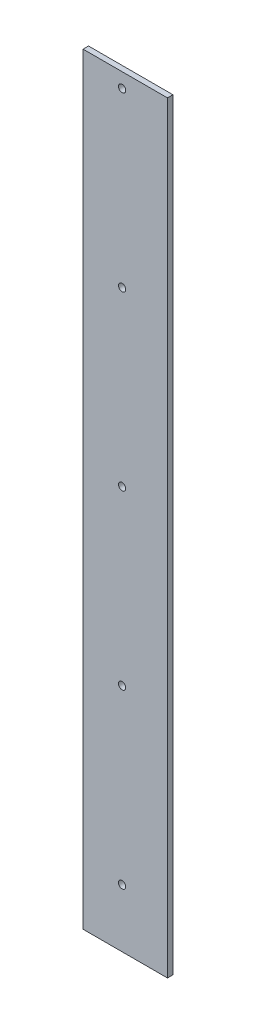
ISO-10303-21;
HEADER;
FILE_DESCRIPTION(('STEP AP214'),'2;1');
FILE_NAME('part.step','',(''),(''),'','','');
FILE_SCHEMA(('AUTOMOTIVE_DESIGN { 1 0 10303 214 1 1 1 1 }'));
ENDSEC;
DATA;
#1=APPLICATION_CONTEXT('core data for automotive mechanical design processes');
#2=APPLICATION_PROTOCOL_DEFINITION('international standard','automotive_design',2000,#1);
#3=PRODUCT_CONTEXT('',#1,'mechanical');
#4=PRODUCT('Part','Part','',(#3));
#5=PRODUCT_RELATED_PRODUCT_CATEGORY('part','',(#4));
#6=PRODUCT_DEFINITION_FORMATION('','',#4);
#7=PRODUCT_DEFINITION_CONTEXT('part definition',#1,'design');
#8=PRODUCT_DEFINITION('design','',#6,#7);
#9=PRODUCT_DEFINITION_SHAPE('','',#8);
#10=(LENGTH_UNIT() NAMED_UNIT(*) SI_UNIT(.MILLI.,.METRE.));
#11=(NAMED_UNIT(*) PLANE_ANGLE_UNIT() SI_UNIT($,.RADIAN.));
#12=(NAMED_UNIT(*) SI_UNIT($,.STERADIAN.) SOLID_ANGLE_UNIT());
#13=UNCERTAINTY_MEASURE_WITH_UNIT(LENGTH_MEASURE(1.E-05),#10,'distance_accuracy_value','');
#14=(GEOMETRIC_REPRESENTATION_CONTEXT(3) GLOBAL_UNCERTAINTY_ASSIGNED_CONTEXT((#13)) GLOBAL_UNIT_ASSIGNED_CONTEXT((#10,
#11,#12)) REPRESENTATION_CONTEXT('',''));
#15=CARTESIAN_POINT('',(0.,0.,0.));
#16=DIRECTION('',(0.,0.,1.));
#17=DIRECTION('',(1.,0.,0.));
#18=AXIS2_PLACEMENT_3D('',#15,#16,#17);
#19=CARTESIAN_POINT('',(0.,0.,3.));
#20=DIRECTION('',(0.,0.,1.));
#21=DIRECTION('',(1.,0.,0.));
#22=AXIS2_PLACEMENT_3D('',#19,#20,#21);
#23=PLANE('',#22);
#24=CARTESIAN_POINT('',(-1.19205738298243,-89.721028691555,3.));
#25=DIRECTION('',(0.,0.,1.));
#26=DIRECTION('',(1.,0.,0.));
#27=AXIS2_PLACEMENT_3D('',#24,#25,#26);
#28=CIRCLE('',#27,2.0000000000209);
#29=CARTESIAN_POINT('',(0.807942617038469,-89.721028691555,3.));
#30=VERTEX_POINT('',#29);
#31=EDGE_CURVE('E137',#30,#30,#28,.T.);
#32=ORIENTED_EDGE('',*,*,#31,.F.);
#33=EDGE_LOOP('',(#32));
#34=FACE_BOUND('',#33,.T.);
#35=CARTESIAN_POINT('',(-1.19205738298044,100.278971308445,3.));
#36=DIRECTION('',(0.,0.,1.));
#37=DIRECTION('',(1.,0.,0.));
#38=AXIS2_PLACEMENT_3D('',#35,#36,#37);
#39=CIRCLE('',#38,2.0000000000209);
#40=CARTESIAN_POINT('',(0.807942617040462,100.278971308445,3.));
#41=VERTEX_POINT('',#40);
#42=EDGE_CURVE('E125',#41,#41,#39,.T.);
#43=ORIENTED_EDGE('',*,*,#42,.F.);
#44=EDGE_LOOP('',(#43));
#45=FACE_BOUND('',#44,.T.);
#46=DIRECTION('',(0.,-1.,0.));
#47=VECTOR('',#46,1.);
#48=CARTESIAN_POINT('',(-22.6920573829741,203.278971308516,3.));
#49=LINE('',#48,#47);
#50=CARTESIAN_POINT('',(-22.6920573829741,203.278971308516,3.));
#51=VERTEX_POINT('',#50);
#52=CARTESIAN_POINT('',(-22.692057382974,-216.721028691483,3.));
#53=VERTEX_POINT('',#52);
#54=EDGE_CURVE('E95',#51,#53,#49,.T.);
#55=ORIENTED_EDGE('',*,*,#54,.T.);
#56=DIRECTION('',(1.,0.,0.));
#57=VECTOR('',#56,1.);
#58=CARTESIAN_POINT('',(-22.692057382974,-216.721028691483,3.));
#59=LINE('',#58,#57);
#60=CARTESIAN_POINT('',(23.8079426170267,-216.721028691483,3.));
#61=VERTEX_POINT('',#60);
#62=EDGE_CURVE('E90',#53,#61,#59,.T.);
#63=ORIENTED_EDGE('',*,*,#62,.T.);
#64=DIRECTION('',(0.,1.,0.));
#65=VECTOR('',#64,1.);
#66=CARTESIAN_POINT('',(23.8079426170266,203.278971308516,3.));
#67=LINE('',#66,#65);
#68=CARTESIAN_POINT('',(23.8079426170266,203.278971308516,3.));
#69=VERTEX_POINT('',#68);
#70=EDGE_CURVE('E93',#61,#69,#67,.T.);
#71=ORIENTED_EDGE('',*,*,#70,.T.);
#72=DIRECTION('',(-1.,0.,0.));
#73=VECTOR('',#72,1.);
#74=CARTESIAN_POINT('',(-22.6920573829741,203.278971308516,3.));
#75=LINE('',#74,#73);
#76=EDGE_CURVE('E60',#69,#51,#75,.T.);
#77=ORIENTED_EDGE('',*,*,#76,.T.);
#78=EDGE_LOOP('',(#55,#63,#71,#77));
#79=FACE_BOUND('',#78,.T.);
#80=CARTESIAN_POINT('',(-1.19205738297945,195.278971308445,3.));
#81=DIRECTION('',(0.,0.,1.));
#82=DIRECTION('',(1.,0.,0.));
#83=AXIS2_PLACEMENT_3D('',#80,#81,#82);
#84=CIRCLE('',#83,2.0000000000209);
#85=CARTESIAN_POINT('',(0.807942617041458,195.278971308445,3.));
#86=VERTEX_POINT('',#85);
#87=EDGE_CURVE('E110',#86,#86,#84,.T.);
#88=ORIENTED_EDGE('',*,*,#87,.F.);
#89=EDGE_LOOP('',(#88));
#90=FACE_BOUND('',#89,.T.);
#91=CARTESIAN_POINT('',(-1.19205738298144,5.27897130844501,3.));
#92=DIRECTION('',(0.,0.,1.));
#93=DIRECTION('',(1.,0.,0.));
#94=AXIS2_PLACEMENT_3D('',#91,#92,#93);
#95=CIRCLE('',#94,2.00000000002091);
#96=CARTESIAN_POINT('',(0.807942617039467,5.27897130844501,3.));
#97=VERTEX_POINT('',#96);
#98=EDGE_CURVE('E131',#97,#97,#95,.T.);
#99=ORIENTED_EDGE('',*,*,#98,.F.);
#100=EDGE_LOOP('',(#99));
#101=FACE_BOUND('',#100,.T.);
#102=CARTESIAN_POINT('',(-1.19205738298343,-184.721028691555,3.));
#103=DIRECTION('',(0.,0.,1.));
#104=DIRECTION('',(1.,0.,0.));
#105=AXIS2_PLACEMENT_3D('',#102,#103,#104);
#106=CIRCLE('',#105,2.0000000000209);
#107=CARTESIAN_POINT('',(0.807942617037473,-184.721028691555,3.));
#108=VERTEX_POINT('',#107);
#109=EDGE_CURVE('E143',#108,#108,#106,.T.);
#110=ORIENTED_EDGE('',*,*,#109,.F.);
#111=EDGE_LOOP('',(#110));
#112=FACE_BOUND('',#111,.T.);
#113=ADVANCED_FACE('F43',(#34,#45,#79,#90,#101,#112),#23,.T.);
#114=CARTESIAN_POINT('',(0.,0.,0.));
#115=DIRECTION('',(0.,0.,1.));
#116=DIRECTION('',(1.,0.,0.));
#117=AXIS2_PLACEMENT_3D('',#114,#115,#116);
#118=PLANE('',#117);
#119=DIRECTION('',(0.,-1.,0.));
#120=VECTOR('',#119,1.);
#121=CARTESIAN_POINT('',(-22.6920573829741,203.278971308516,0.));
#122=LINE('',#121,#120);
#123=CARTESIAN_POINT('',(-22.6920573829741,203.278971308516,0.));
#124=VERTEX_POINT('',#123);
#125=CARTESIAN_POINT('',(-22.692057382974,-216.721028691483,0.));
#126=VERTEX_POINT('',#125);
#127=EDGE_CURVE('E107',#124,#126,#122,.T.);
#128=ORIENTED_EDGE('',*,*,#127,.F.);
#129=DIRECTION('',(-1.,0.,0.));
#130=VECTOR('',#129,1.);
#131=CARTESIAN_POINT('',(-22.6920573829741,203.278971308516,0.));
#132=LINE('',#131,#130);
#133=CARTESIAN_POINT('',(23.8079426170266,203.278971308516,0.));
#134=VERTEX_POINT('',#133);
#135=EDGE_CURVE('E83',#134,#124,#132,.T.);
#136=ORIENTED_EDGE('',*,*,#135,.F.);
#137=DIRECTION('',(0.,1.,0.));
#138=VECTOR('',#137,1.);
#139=CARTESIAN_POINT('',(23.8079426170266,203.278971308516,0.));
#140=LINE('',#139,#138);
#141=CARTESIAN_POINT('',(23.8079426170267,-216.721028691483,0.));
#142=VERTEX_POINT('',#141);
#143=EDGE_CURVE('E77',#142,#134,#140,.T.);
#144=ORIENTED_EDGE('',*,*,#143,.F.);
#145=DIRECTION('',(1.,0.,0.));
#146=VECTOR('',#145,1.);
#147=CARTESIAN_POINT('',(-22.692057382974,-216.721028691483,0.));
#148=LINE('',#147,#146);
#149=EDGE_CURVE('E99',#126,#142,#148,.T.);
#150=ORIENTED_EDGE('',*,*,#149,.F.);
#151=EDGE_LOOP('',(#128,#136,#144,#150));
#152=FACE_BOUND('',#151,.T.);
#153=CARTESIAN_POINT('',(-1.19205738297945,195.278971308445,0.));
#154=DIRECTION('',(0.,0.,1.));
#155=DIRECTION('',(1.,0.,0.));
#156=AXIS2_PLACEMENT_3D('',#153,#154,#155);
#157=CIRCLE('',#156,2.0000000000209);
#158=CARTESIAN_POINT('',(0.807942617041458,195.278971308445,0.));
#159=VERTEX_POINT('',#158);
#160=EDGE_CURVE('E122',#159,#159,#157,.T.);
#161=ORIENTED_EDGE('',*,*,#160,.T.);
#162=EDGE_LOOP('',(#161));
#163=FACE_BOUND('',#162,.T.);
#164=CARTESIAN_POINT('',(-1.19205738298044,100.278971308445,0.));
#165=DIRECTION('',(0.,0.,1.));
#166=DIRECTION('',(1.,0.,0.));
#167=AXIS2_PLACEMENT_3D('',#164,#165,#166);
#168=CIRCLE('',#167,2.0000000000209);
#169=CARTESIAN_POINT('',(0.807942617040462,100.278971308445,0.));
#170=VERTEX_POINT('',#169);
#171=EDGE_CURVE('E128',#170,#170,#168,.T.);
#172=ORIENTED_EDGE('',*,*,#171,.T.);
#173=EDGE_LOOP('',(#172));
#174=FACE_BOUND('',#173,.T.);
#175=CARTESIAN_POINT('',(-1.19205738298144,5.27897130844501,0.));
#176=DIRECTION('',(0.,0.,1.));
#177=DIRECTION('',(1.,0.,0.));
#178=AXIS2_PLACEMENT_3D('',#175,#176,#177);
#179=CIRCLE('',#178,2.00000000002091);
#180=CARTESIAN_POINT('',(0.807942617039467,5.27897130844501,0.));
#181=VERTEX_POINT('',#180);
#182=EDGE_CURVE('E134',#181,#181,#179,.T.);
#183=ORIENTED_EDGE('',*,*,#182,.T.);
#184=EDGE_LOOP('',(#183));
#185=FACE_BOUND('',#184,.T.);
#186=CARTESIAN_POINT('',(-1.19205738298243,-89.721028691555,0.));
#187=DIRECTION('',(0.,0.,1.));
#188=DIRECTION('',(1.,0.,0.));
#189=AXIS2_PLACEMENT_3D('',#186,#187,#188);
#190=CIRCLE('',#189,2.0000000000209);
#191=CARTESIAN_POINT('',(0.807942617038469,-89.721028691555,0.));
#192=VERTEX_POINT('',#191);
#193=EDGE_CURVE('E140',#192,#192,#190,.T.);
#194=ORIENTED_EDGE('',*,*,#193,.T.);
#195=EDGE_LOOP('',(#194));
#196=FACE_BOUND('',#195,.T.);
#197=CARTESIAN_POINT('',(-1.19205738298343,-184.721028691555,0.));
#198=DIRECTION('',(0.,0.,1.));
#199=DIRECTION('',(1.,0.,0.));
#200=AXIS2_PLACEMENT_3D('',#197,#198,#199);
#201=CIRCLE('',#200,2.0000000000209);
#202=CARTESIAN_POINT('',(0.807942617037473,-184.721028691555,0.));
#203=VERTEX_POINT('',#202);
#204=EDGE_CURVE('E146',#203,#203,#201,.T.);
#205=ORIENTED_EDGE('',*,*,#204,.T.);
#206=EDGE_LOOP('',(#205));
#207=FACE_BOUND('',#206,.T.);
#208=ADVANCED_FACE('F118',(#152,#163,#174,#185,#196,#207),#118,.F.);
#209=CARTESIAN_POINT('',(-22.6920573829741,203.278971308516,3.));
#210=DIRECTION('',(1.,0.,0.));
#211=DIRECTION('',(0.,1.,0.));
#212=AXIS2_PLACEMENT_3D('',#209,#210,#211);
#213=PLANE('',#212);
#214=ORIENTED_EDGE('',*,*,#127,.T.);
#215=DIRECTION('',(0.,0.,-1.));
#216=VECTOR('',#215,1.);
#217=CARTESIAN_POINT('',(-22.692057382974,-216.721028691483,3.));
#218=LINE('',#217,#216);
#219=EDGE_CURVE('E13',#53,#126,#218,.T.);
#220=ORIENTED_EDGE('',*,*,#219,.F.);
#221=ORIENTED_EDGE('',*,*,#54,.F.);
#222=DIRECTION('',(0.,0.,-1.));
#223=VECTOR('',#222,1.);
#224=CARTESIAN_POINT('',(-22.6920573829741,203.278971308516,3.));
#225=LINE('',#224,#223);
#226=EDGE_CURVE('E103',#51,#124,#225,.T.);
#227=ORIENTED_EDGE('',*,*,#226,.T.);
#228=EDGE_LOOP('',(#214,#220,#221,#227));
#229=FACE_BOUND('',#228,.T.);
#230=ADVANCED_FACE('F45',(#229),#213,.F.);
#231=CARTESIAN_POINT('',(-22.692057382974,-216.721028691483,3.));
#232=DIRECTION('',(0.,1.,0.));
#233=DIRECTION('',(0.,0.,1.));
#234=AXIS2_PLACEMENT_3D('',#231,#232,#233);
#235=PLANE('',#234);
#236=ORIENTED_EDGE('',*,*,#149,.T.);
#237=DIRECTION('',(0.,0.,-1.));
#238=VECTOR('',#237,1.);
#239=CARTESIAN_POINT('',(23.8079426170267,-216.721028691483,3.));
#240=LINE('',#239,#238);
#241=EDGE_CURVE('E52',#61,#142,#240,.T.);
#242=ORIENTED_EDGE('',*,*,#241,.F.);
#243=ORIENTED_EDGE('',*,*,#62,.F.);
#244=ORIENTED_EDGE('',*,*,#219,.T.);
#245=EDGE_LOOP('',(#236,#242,#243,#244));
#246=FACE_BOUND('',#245,.T.);
#247=ADVANCED_FACE('F98',(#246),#235,.F.);
#248=CARTESIAN_POINT('',(23.8079426170266,203.278971308516,3.));
#249=DIRECTION('',(-1.,0.,0.));
#250=DIRECTION('',(0.,-1.,0.));
#251=AXIS2_PLACEMENT_3D('',#248,#249,#250);
#252=PLANE('',#251);
#253=ORIENTED_EDGE('',*,*,#143,.T.);
#254=DIRECTION('',(0.,0.,-1.));
#255=VECTOR('',#254,1.);
#256=CARTESIAN_POINT('',(23.8079426170266,203.278971308516,3.));
#257=LINE('',#256,#255);
#258=EDGE_CURVE('E100',#69,#134,#257,.T.);
#259=ORIENTED_EDGE('',*,*,#258,.F.);
#260=ORIENTED_EDGE('',*,*,#70,.F.);
#261=ORIENTED_EDGE('',*,*,#241,.T.);
#262=EDGE_LOOP('',(#253,#259,#260,#261));
#263=FACE_BOUND('',#262,.T.);
#264=ADVANCED_FACE('F101',(#263),#252,.F.);
#265=CARTESIAN_POINT('',(-22.6920573829741,203.278971308516,3.));
#266=DIRECTION('',(0.,-1.,0.));
#267=DIRECTION('',(0.,0.,-1.));
#268=AXIS2_PLACEMENT_3D('',#265,#266,#267);
#269=PLANE('',#268);
#270=ORIENTED_EDGE('',*,*,#135,.T.);
#271=ORIENTED_EDGE('',*,*,#226,.F.);
#272=ORIENTED_EDGE('',*,*,#76,.F.);
#273=ORIENTED_EDGE('',*,*,#258,.T.);
#274=EDGE_LOOP('',(#270,#271,#272,#273));
#275=FACE_BOUND('',#274,.T.);
#276=ADVANCED_FACE('F115',(#275),#269,.F.);
#277=CARTESIAN_POINT('',(-1.19205738297945,195.278971308445,3.));
#278=DIRECTION('',(0.,0.,-1.));
#279=DIRECTION('',(-1.,0.,0.));
#280=AXIS2_PLACEMENT_3D('',#277,#278,#279);
#281=CYLINDRICAL_SURFACE('',#280,2.0000000000209);
#282=ORIENTED_EDGE('',*,*,#87,.T.);
#283=EDGE_LOOP('',(#282));
#284=FACE_BOUND('',#283,.T.);
#285=ORIENTED_EDGE('',*,*,#160,.F.);
#286=EDGE_LOOP('',(#285));
#287=FACE_BOUND('',#286,.T.);
#288=ADVANCED_FACE('F165',(#284,#287),#281,.F.);
#289=CARTESIAN_POINT('',(-1.19205738298044,100.278971308445,3.));
#290=DIRECTION('',(0.,0.,-1.));
#291=DIRECTION('',(-1.,0.,0.));
#292=AXIS2_PLACEMENT_3D('',#289,#290,#291);
#293=CYLINDRICAL_SURFACE('',#292,2.0000000000209);
#294=ORIENTED_EDGE('',*,*,#42,.T.);
#295=EDGE_LOOP('',(#294));
#296=FACE_BOUND('',#295,.T.);
#297=ORIENTED_EDGE('',*,*,#171,.F.);
#298=EDGE_LOOP('',(#297));
#299=FACE_BOUND('',#298,.T.);
#300=ADVANCED_FACE('F211',(#296,#299),#293,.F.);
#301=CARTESIAN_POINT('',(-1.19205738298144,5.27897130844501,3.));
#302=DIRECTION('',(0.,0.,-1.));
#303=DIRECTION('',(-1.,0.,0.));
#304=AXIS2_PLACEMENT_3D('',#301,#302,#303);
#305=CYLINDRICAL_SURFACE('',#304,2.00000000002091);
#306=ORIENTED_EDGE('',*,*,#98,.T.);
#307=EDGE_LOOP('',(#306));
#308=FACE_BOUND('',#307,.T.);
#309=ORIENTED_EDGE('',*,*,#182,.F.);
#310=EDGE_LOOP('',(#309));
#311=FACE_BOUND('',#310,.T.);
#312=ADVANCED_FACE('F219',(#308,#311),#305,.F.);
#313=CARTESIAN_POINT('',(-1.19205738298243,-89.721028691555,3.));
#314=DIRECTION('',(0.,0.,-1.));
#315=DIRECTION('',(-1.,0.,0.));
#316=AXIS2_PLACEMENT_3D('',#313,#314,#315);
#317=CYLINDRICAL_SURFACE('',#316,2.0000000000209);
#318=ORIENTED_EDGE('',*,*,#31,.T.);
#319=EDGE_LOOP('',(#318));
#320=FACE_BOUND('',#319,.T.);
#321=ORIENTED_EDGE('',*,*,#193,.F.);
#322=EDGE_LOOP('',(#321));
#323=FACE_BOUND('',#322,.T.);
#324=ADVANCED_FACE('F227',(#320,#323),#317,.F.);
#325=CARTESIAN_POINT('',(-1.19205738298343,-184.721028691555,3.));
#326=DIRECTION('',(0.,0.,-1.));
#327=DIRECTION('',(-1.,0.,0.));
#328=AXIS2_PLACEMENT_3D('',#325,#326,#327);
#329=CYLINDRICAL_SURFACE('',#328,2.0000000000209);
#330=ORIENTED_EDGE('',*,*,#109,.T.);
#331=EDGE_LOOP('',(#330));
#332=FACE_BOUND('',#331,.T.);
#333=ORIENTED_EDGE('',*,*,#204,.F.);
#334=EDGE_LOOP('',(#333));
#335=FACE_BOUND('',#334,.T.);
#336=ADVANCED_FACE('F152',(#332,#335),#329,.F.);
#337=CLOSED_SHELL('',(#113,#208,#230,#247,#264,#276,#288,#300,#312,#324,#336));
#338=MANIFOLD_SOLID_BREP('B2',#337);
#339=ADVANCED_BREP_SHAPE_REPRESENTATION('',(#18,#338),#14);
#340=SHAPE_DEFINITION_REPRESENTATION(#9,#339);
ENDSEC;
END-ISO-10303-21;
